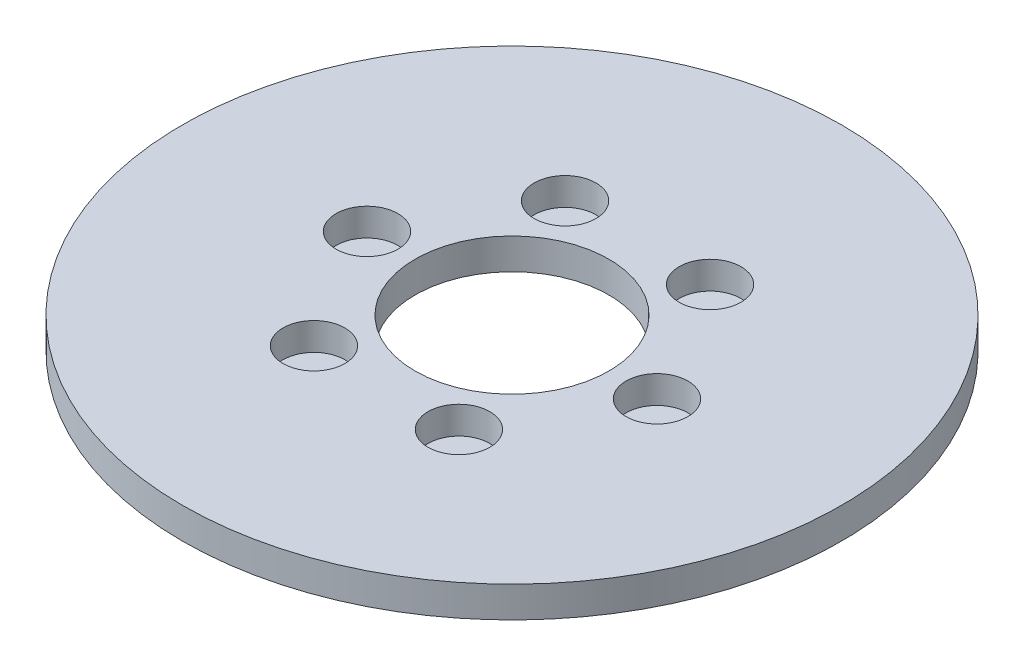
ISO-10303-21;
HEADER;
FILE_DESCRIPTION(('STEP AP214'),'2;1');
FILE_NAME('part.step','',(''),(''),'','','');
FILE_SCHEMA(('AUTOMOTIVE_DESIGN { 1 0 10303 214 1 1 1 1 }'));
ENDSEC;
DATA;
#1=APPLICATION_CONTEXT('core data for automotive mechanical design processes');
#2=APPLICATION_PROTOCOL_DEFINITION('international standard','automotive_design',2000,#1);
#3=PRODUCT_CONTEXT('',#1,'mechanical');
#4=PRODUCT('Part','Part','',(#3));
#5=PRODUCT_RELATED_PRODUCT_CATEGORY('part','',(#4));
#6=PRODUCT_DEFINITION_FORMATION('','',#4);
#7=PRODUCT_DEFINITION_CONTEXT('part definition',#1,'design');
#8=PRODUCT_DEFINITION('design','',#6,#7);
#9=PRODUCT_DEFINITION_SHAPE('','',#8);
#10=(LENGTH_UNIT() NAMED_UNIT(*) SI_UNIT(.MILLI.,.METRE.));
#11=(NAMED_UNIT(*) PLANE_ANGLE_UNIT() SI_UNIT($,.RADIAN.));
#12=(NAMED_UNIT(*) SI_UNIT($,.STERADIAN.) SOLID_ANGLE_UNIT());
#13=UNCERTAINTY_MEASURE_WITH_UNIT(LENGTH_MEASURE(1.E-05),#10,'distance_accuracy_value','');
#14=(GEOMETRIC_REPRESENTATION_CONTEXT(3) GLOBAL_UNCERTAINTY_ASSIGNED_CONTEXT((#13)) GLOBAL_UNIT_ASSIGNED_CONTEXT((#10,
#11,#12)) REPRESENTATION_CONTEXT('',''));
#15=CARTESIAN_POINT('',(0.,0.,0.));
#16=DIRECTION('',(0.,0.,1.));
#17=DIRECTION('',(1.,0.,0.));
#18=AXIS2_PLACEMENT_3D('',#15,#16,#17);
#19=CARTESIAN_POINT('',(0.,8.,0.));
#20=DIRECTION('',(0.,-1.,0.));
#21=DIRECTION('',(0.,0.,-1.));
#22=AXIS2_PLACEMENT_3D('',#19,#20,#21);
#23=CYLINDRICAL_SURFACE('',#22,85.);
#24=CARTESIAN_POINT('',(0.,8.,0.));
#25=DIRECTION('',(0.,1.,0.));
#26=DIRECTION('',(0.,0.,1.));
#27=AXIS2_PLACEMENT_3D('',#24,#25,#26);
#28=CIRCLE('',#27,85.);
#29=CARTESIAN_POINT('',(0.,8.,85.));
#30=VERTEX_POINT('',#29);
#31=EDGE_CURVE('E10',#30,#30,#28,.T.);
#32=ORIENTED_EDGE('',*,*,#31,.F.);
#33=EDGE_LOOP('',(#32));
#34=FACE_BOUND('',#33,.T.);
#35=CARTESIAN_POINT('',(0.,0.,0.));
#36=DIRECTION('',(0.,1.,0.));
#37=DIRECTION('',(0.,0.,1.));
#38=AXIS2_PLACEMENT_3D('',#35,#36,#37);
#39=CIRCLE('',#38,85.);
#40=CARTESIAN_POINT('',(0.,0.,85.));
#41=VERTEX_POINT('',#40);
#42=EDGE_CURVE('E37',#41,#41,#39,.T.);
#43=ORIENTED_EDGE('',*,*,#42,.T.);
#44=EDGE_LOOP('',(#43));
#45=FACE_BOUND('',#44,.T.);
#46=ADVANCED_FACE('F40',(#34,#45),#23,.T.);
#47=CARTESIAN_POINT('',(0.,8.,0.));
#48=DIRECTION('',(0.,1.,0.));
#49=DIRECTION('',(0.,0.,1.));
#50=AXIS2_PLACEMENT_3D('',#47,#48,#49);
#51=PLANE('',#50);
#52=CARTESIAN_POINT('',(-18.6976403079202,8.,-32.3852629949647));
#53=DIRECTION('',(0.,1.,0.));
#54=DIRECTION('',(-0.866025403784433,0.,0.50000000000001));
#55=AXIS2_PLACEMENT_3D('',#52,#53,#54);
#56=CIRCLE('',#55,7.96917494469382);
#57=CARTESIAN_POINT('',(-25.5991482572275,8.,-28.4006755226177));
#58=VERTEX_POINT('',#57);
#59=EDGE_CURVE('E70',#58,#58,#56,.T.);
#60=ORIENTED_EDGE('',*,*,#59,.F.);
#61=EDGE_LOOP('',(#60));
#62=FACE_BOUND('',#61,.T.);
#63=CARTESIAN_POINT('',(18.6976403079195,8.,-32.3852629949651));
#64=DIRECTION('',(0.,1.,0.));
#65=DIRECTION('',(-0.866025403784443,0.,-0.499999999999992));
#66=AXIS2_PLACEMENT_3D('',#63,#64,#65);
#67=CIRCLE('',#66,7.96917494469382);
#68=CARTESIAN_POINT('',(11.7961323586122,8.,-36.369850467312));
#69=VERTEX_POINT('',#68);
#70=EDGE_CURVE('E71',#69,#69,#67,.T.);
#71=ORIENTED_EDGE('',*,*,#70,.F.);
#72=EDGE_LOOP('',(#71));
#73=FACE_BOUND('',#72,.T.);
#74=CARTESIAN_POINT('',(37.3952806158397,8.,0.));
#75=DIRECTION('',(0.,1.,0.));
#76=DIRECTION('',(0.,0.,-1.));
#77=AXIS2_PLACEMENT_3D('',#74,#75,#76);
#78=CIRCLE('',#77,7.96917494469382);
#79=CARTESIAN_POINT('',(37.3952806158397,8.,-7.96917494469382));
#80=VERTEX_POINT('',#79);
#81=EDGE_CURVE('E78',#80,#80,#78,.T.);
#82=ORIENTED_EDGE('',*,*,#81,.F.);
#83=EDGE_LOOP('',(#82));
#84=FACE_BOUND('',#83,.T.);
#85=CARTESIAN_POINT('',(18.69764030792,8.,32.3852629949649));
#86=DIRECTION('',(0.,1.,0.));
#87=DIRECTION('',(0.866025403784436,0.,-0.500000000000004));
#88=AXIS2_PLACEMENT_3D('',#85,#86,#87);
#89=CIRCLE('',#88,7.96917494469382);
#90=CARTESIAN_POINT('',(25.5991482572273,8.,28.4006755226179));
#91=VERTEX_POINT('',#90);
#92=EDGE_CURVE('E84',#91,#91,#89,.T.);
#93=ORIENTED_EDGE('',*,*,#92,.F.);
#94=EDGE_LOOP('',(#93));
#95=FACE_BOUND('',#94,.T.);
#96=CARTESIAN_POINT('',(-18.6976403079198,8.,32.385262994965));
#97=DIRECTION('',(0.,1.,0.));
#98=DIRECTION('',(0.86602540378444,0.,0.499999999999998));
#99=AXIS2_PLACEMENT_3D('',#96,#97,#98);
#100=CIRCLE('',#99,7.96917494469382);
#101=CARTESIAN_POINT('',(-11.7961323586125,8.,36.3698504673119));
#102=VERTEX_POINT('',#101);
#103=EDGE_CURVE('E61',#102,#102,#100,.T.);
#104=ORIENTED_EDGE('',*,*,#103,.F.);
#105=EDGE_LOOP('',(#104));
#106=FACE_BOUND('',#105,.T.);
#107=CARTESIAN_POINT('',(-37.3952806158397,8.,0.));
#108=DIRECTION('',(0.,1.,0.));
#109=DIRECTION('',(0.,0.,1.));
#110=AXIS2_PLACEMENT_3D('',#107,#108,#109);
#111=CIRCLE('',#110,7.96917494469382);
#112=CARTESIAN_POINT('',(-37.3952806158397,8.,7.96917494469382));
#113=VERTEX_POINT('',#112);
#114=EDGE_CURVE('E54',#113,#113,#111,.T.);
#115=ORIENTED_EDGE('',*,*,#114,.F.);
#116=EDGE_LOOP('',(#115));
#117=FACE_BOUND('',#116,.T.);
#118=CARTESIAN_POINT('',(0.,8.,0.));
#119=DIRECTION('',(0.,1.,0.));
#120=DIRECTION('',(0.,0.,1.));
#121=AXIS2_PLACEMENT_3D('',#118,#119,#120);
#122=CIRCLE('',#121,25.);
#123=CARTESIAN_POINT('',(0.,8.,25.));
#124=VERTEX_POINT('',#123);
#125=EDGE_CURVE('E50',#124,#124,#122,.T.);
#126=ORIENTED_EDGE('',*,*,#125,.F.);
#127=EDGE_LOOP('',(#126));
#128=FACE_BOUND('',#127,.T.);
#129=ORIENTED_EDGE('',*,*,#31,.T.);
#130=EDGE_LOOP('',(#129));
#131=FACE_BOUND('',#130,.T.);
#132=ADVANCED_FACE('F99',(#62,#73,#84,#95,#106,#117,#128,#131),#51,.T.);
#133=CARTESIAN_POINT('',(0.,0.,0.));
#134=DIRECTION('',(0.,1.,0.));
#135=DIRECTION('',(0.,0.,1.));
#136=AXIS2_PLACEMENT_3D('',#133,#134,#135);
#137=PLANE('',#136);
#138=CARTESIAN_POINT('',(0.,0.,0.));
#139=DIRECTION('',(0.,1.,0.));
#140=DIRECTION('',(0.,0.,1.));
#141=AXIS2_PLACEMENT_3D('',#138,#139,#140);
#142=CIRCLE('',#141,25.);
#143=CARTESIAN_POINT('',(0.,0.,25.));
#144=VERTEX_POINT('',#143);
#145=EDGE_CURVE('E47',#144,#144,#142,.T.);
#146=ORIENTED_EDGE('',*,*,#145,.T.);
#147=EDGE_LOOP('',(#146));
#148=FACE_BOUND('',#147,.T.);
#149=ORIENTED_EDGE('',*,*,#42,.F.);
#150=EDGE_LOOP('',(#149));
#151=FACE_BOUND('',#150,.T.);
#152=ADVANCED_FACE('F103',(#148,#151),#137,.F.);
#153=CARTESIAN_POINT('',(0.,8.,0.));
#154=DIRECTION('',(0.,-1.,0.));
#155=DIRECTION('',(0.,0.,-1.));
#156=AXIS2_PLACEMENT_3D('',#153,#154,#155);
#157=CYLINDRICAL_SURFACE('',#156,25.);
#158=ORIENTED_EDGE('',*,*,#125,.T.);
#159=EDGE_LOOP('',(#158));
#160=FACE_BOUND('',#159,.T.);
#161=ORIENTED_EDGE('',*,*,#145,.F.);
#162=EDGE_LOOP('',(#161));
#163=FACE_BOUND('',#162,.T.);
#164=ADVANCED_FACE('F115',(#160,#163),#157,.F.);
#165=CARTESIAN_POINT('',(-37.3952806158397,0.882244478678552,0.));
#166=DIRECTION('',(0.,1.,0.));
#167=DIRECTION('',(0.,0.,1.));
#168=AXIS2_PLACEMENT_3D('',#165,#166,#167);
#169=CYLINDRICAL_SURFACE('',#168,7.96917494469382);
#170=CARTESIAN_POINT('',(-37.3952806158397,0.882244478678552,0.));
#171=DIRECTION('',(0.,1.,0.));
#172=DIRECTION('',(0.,0.,1.));
#173=AXIS2_PLACEMENT_3D('',#170,#171,#172);
#174=CIRCLE('',#173,7.96917494469382);
#175=CARTESIAN_POINT('',(-37.3952806158397,0.882244478678552,7.96917494469382));
#176=VERTEX_POINT('',#175);
#177=EDGE_CURVE('E55',#176,#176,#174,.T.);
#178=ORIENTED_EDGE('',*,*,#177,.F.);
#179=EDGE_LOOP('',(#178));
#180=FACE_BOUND('',#179,.T.);
#181=ORIENTED_EDGE('',*,*,#114,.T.);
#182=EDGE_LOOP('',(#181));
#183=FACE_BOUND('',#182,.T.);
#184=ADVANCED_FACE('F113',(#180,#183),#169,.F.);
#185=CARTESIAN_POINT('',(-37.3952806158397,0.882244478678552,0.));
#186=DIRECTION('',(0.,1.,0.));
#187=DIRECTION('',(0.,0.,1.));
#188=AXIS2_PLACEMENT_3D('',#185,#186,#187);
#189=PLANE('',#188);
#190=ORIENTED_EDGE('',*,*,#177,.T.);
#191=EDGE_LOOP('',(#190));
#192=FACE_BOUND('',#191,.T.);
#193=ADVANCED_FACE('F144',(#192),#189,.T.);
#194=CARTESIAN_POINT('',(-18.6976403079198,0.882244478678552,32.385262994965));
#195=DIRECTION('',(0.,1.,0.));
#196=DIRECTION('',(0.,0.,1.));
#197=AXIS2_PLACEMENT_3D('',#194,#195,#196);
#198=CYLINDRICAL_SURFACE('',#197,7.96917494469382);
#199=CARTESIAN_POINT('',(-18.6976403079198,0.882244478678552,32.385262994965));
#200=DIRECTION('',(0.,1.,0.));
#201=DIRECTION('',(0.86602540378444,0.,0.499999999999998));
#202=AXIS2_PLACEMENT_3D('',#199,#200,#201);
#203=CIRCLE('',#202,7.96917494469382);
#204=CARTESIAN_POINT('',(-11.7961323586125,0.882244478678552,36.3698504673119));
#205=VERTEX_POINT('',#204);
#206=EDGE_CURVE('E59',#205,#205,#203,.T.);
#207=ORIENTED_EDGE('',*,*,#206,.F.);
#208=EDGE_LOOP('',(#207));
#209=FACE_BOUND('',#208,.T.);
#210=ORIENTED_EDGE('',*,*,#103,.T.);
#211=EDGE_LOOP('',(#210));
#212=FACE_BOUND('',#211,.T.);
#213=ADVANCED_FACE('F153',(#209,#212),#198,.F.);
#214=CARTESIAN_POINT('',(-18.6976403079198,0.882244478678552,32.385262994965));
#215=DIRECTION('',(0.,1.,0.));
#216=DIRECTION('',(0.86602540378444,0.,0.499999999999998));
#217=AXIS2_PLACEMENT_3D('',#214,#215,#216);
#218=PLANE('',#217);
#219=ORIENTED_EDGE('',*,*,#206,.T.);
#220=EDGE_LOOP('',(#219));
#221=FACE_BOUND('',#220,.T.);
#222=ADVANCED_FACE('F96',(#221),#218,.T.);
#223=CARTESIAN_POINT('',(18.69764030792,0.882244478678552,32.3852629949649));
#224=DIRECTION('',(0.,1.,0.));
#225=DIRECTION('',(0.,0.,1.));
#226=AXIS2_PLACEMENT_3D('',#223,#224,#225);
#227=CYLINDRICAL_SURFACE('',#226,7.96917494469382);
#228=CARTESIAN_POINT('',(18.69764030792,0.882244478678552,32.3852629949649));
#229=DIRECTION('',(0.,1.,0.));
#230=DIRECTION('',(0.866025403784436,0.,-0.500000000000004));
#231=AXIS2_PLACEMENT_3D('',#228,#229,#230);
#232=CIRCLE('',#231,7.96917494469382);
#233=CARTESIAN_POINT('',(25.5991482572273,0.882244478678552,28.4006755226179));
#234=VERTEX_POINT('',#233);
#235=EDGE_CURVE('E63',#234,#234,#232,.T.);
#236=ORIENTED_EDGE('',*,*,#235,.F.);
#237=EDGE_LOOP('',(#236));
#238=FACE_BOUND('',#237,.T.);
#239=ORIENTED_EDGE('',*,*,#92,.T.);
#240=EDGE_LOOP('',(#239));
#241=FACE_BOUND('',#240,.T.);
#242=ADVANCED_FACE('F91',(#238,#241),#227,.F.);
#243=CARTESIAN_POINT('',(18.69764030792,0.882244478678552,32.3852629949649));
#244=DIRECTION('',(0.,1.,0.));
#245=DIRECTION('',(0.866025403784436,0.,-0.500000000000004));
#246=AXIS2_PLACEMENT_3D('',#243,#244,#245);
#247=PLANE('',#246);
#248=ORIENTED_EDGE('',*,*,#235,.T.);
#249=EDGE_LOOP('',(#248));
#250=FACE_BOUND('',#249,.T.);
#251=ADVANCED_FACE('F93',(#250),#247,.T.);
#252=CARTESIAN_POINT('',(37.3952806158397,0.882244478678552,0.));
#253=DIRECTION('',(0.,1.,0.));
#254=DIRECTION('',(0.,0.,1.));
#255=AXIS2_PLACEMENT_3D('',#252,#253,#254);
#256=CYLINDRICAL_SURFACE('',#255,7.96917494469382);
#257=CARTESIAN_POINT('',(37.3952806158397,0.882244478678552,0.));
#258=DIRECTION('',(0.,1.,0.));
#259=DIRECTION('',(0.,0.,-1.));
#260=AXIS2_PLACEMENT_3D('',#257,#258,#259);
#261=CIRCLE('',#260,7.96917494469382);
#262=CARTESIAN_POINT('',(37.3952806158397,0.882244478678552,-7.96917494469382));
#263=VERTEX_POINT('',#262);
#264=EDGE_CURVE('E85',#263,#263,#261,.T.);
#265=ORIENTED_EDGE('',*,*,#264,.F.);
#266=EDGE_LOOP('',(#265));
#267=FACE_BOUND('',#266,.T.);
#268=ORIENTED_EDGE('',*,*,#81,.T.);
#269=EDGE_LOOP('',(#268));
#270=FACE_BOUND('',#269,.T.);
#271=ADVANCED_FACE('F187',(#267,#270),#256,.F.);
#272=CARTESIAN_POINT('',(37.3952806158397,0.882244478678552,0.));
#273=DIRECTION('',(0.,1.,0.));
#274=DIRECTION('',(0.,0.,-1.));
#275=AXIS2_PLACEMENT_3D('',#272,#273,#274);
#276=PLANE('',#275);
#277=ORIENTED_EDGE('',*,*,#264,.T.);
#278=EDGE_LOOP('',(#277));
#279=FACE_BOUND('',#278,.T.);
#280=ADVANCED_FACE('F198',(#279),#276,.T.);
#281=CARTESIAN_POINT('',(18.6976403079195,0.882244478678552,-32.3852629949651));
#282=DIRECTION('',(0.,1.,0.));
#283=DIRECTION('',(0.,0.,1.));
#284=AXIS2_PLACEMENT_3D('',#281,#282,#283);
#285=CYLINDRICAL_SURFACE('',#284,7.96917494469382);
#286=CARTESIAN_POINT('',(18.6976403079195,0.882244478678552,-32.3852629949651));
#287=DIRECTION('',(0.,1.,0.));
#288=DIRECTION('',(-0.866025403784443,0.,-0.499999999999992));
#289=AXIS2_PLACEMENT_3D('',#286,#287,#288);
#290=CIRCLE('',#289,7.96917494469382);
#291=CARTESIAN_POINT('',(11.7961323586122,0.882244478678552,-36.369850467312));
#292=VERTEX_POINT('',#291);
#293=EDGE_CURVE('E76',#292,#292,#290,.T.);
#294=ORIENTED_EDGE('',*,*,#293,.F.);
#295=EDGE_LOOP('',(#294));
#296=FACE_BOUND('',#295,.T.);
#297=ORIENTED_EDGE('',*,*,#70,.T.);
#298=EDGE_LOOP('',(#297));
#299=FACE_BOUND('',#298,.T.);
#300=ADVANCED_FACE('F202',(#296,#299),#285,.F.);
#301=CARTESIAN_POINT('',(18.6976403079195,0.882244478678552,-32.3852629949651));
#302=DIRECTION('',(0.,1.,0.));
#303=DIRECTION('',(-0.866025403784443,0.,-0.499999999999992));
#304=AXIS2_PLACEMENT_3D('',#301,#302,#303);
#305=PLANE('',#304);
#306=ORIENTED_EDGE('',*,*,#293,.T.);
#307=EDGE_LOOP('',(#306));
#308=FACE_BOUND('',#307,.T.);
#309=ADVANCED_FACE('F212',(#308),#305,.T.);
#310=CARTESIAN_POINT('',(-18.6976403079202,0.882244478678552,-32.3852629949647));
#311=DIRECTION('',(0.,1.,0.));
#312=DIRECTION('',(0.,0.,1.));
#313=AXIS2_PLACEMENT_3D('',#310,#311,#312);
#314=CYLINDRICAL_SURFACE('',#313,7.96917494469382);
#315=CARTESIAN_POINT('',(-18.6976403079202,0.882244478678552,-32.3852629949647));
#316=DIRECTION('',(0.,1.,0.));
#317=DIRECTION('',(-0.866025403784433,0.,0.50000000000001));
#318=AXIS2_PLACEMENT_3D('',#315,#316,#317);
#319=CIRCLE('',#318,7.96917494469382);
#320=CARTESIAN_POINT('',(-25.5991482572275,0.882244478678552,-28.4006755226177));
#321=VERTEX_POINT('',#320);
#322=EDGE_CURVE('E69',#321,#321,#319,.T.);
#323=ORIENTED_EDGE('',*,*,#322,.F.);
#324=EDGE_LOOP('',(#323));
#325=FACE_BOUND('',#324,.T.);
#326=ORIENTED_EDGE('',*,*,#59,.T.);
#327=EDGE_LOOP('',(#326));
#328=FACE_BOUND('',#327,.T.);
#329=ADVANCED_FACE('F224',(#325,#328),#314,.F.);
#330=CARTESIAN_POINT('',(-18.6976403079202,0.882244478678552,-32.3852629949647));
#331=DIRECTION('',(0.,1.,0.));
#332=DIRECTION('',(-0.866025403784433,0.,0.50000000000001));
#333=AXIS2_PLACEMENT_3D('',#330,#331,#332);
#334=PLANE('',#333);
#335=ORIENTED_EDGE('',*,*,#322,.T.);
#336=EDGE_LOOP('',(#335));
#337=FACE_BOUND('',#336,.T.);
#338=ADVANCED_FACE('F235',(#337),#334,.T.);
#339=CLOSED_SHELL('',(#46,#132,#152,#164,#184,#193,#213,#222,#242,#251,#271,#280,#300,#309,#329,#338));
#340=MANIFOLD_SOLID_BREP('B2',#339);
#341=ADVANCED_BREP_SHAPE_REPRESENTATION('',(#18,#340),#14);
#342=SHAPE_DEFINITION_REPRESENTATION(#9,#341);
ENDSEC;
END-ISO-10303-21;
